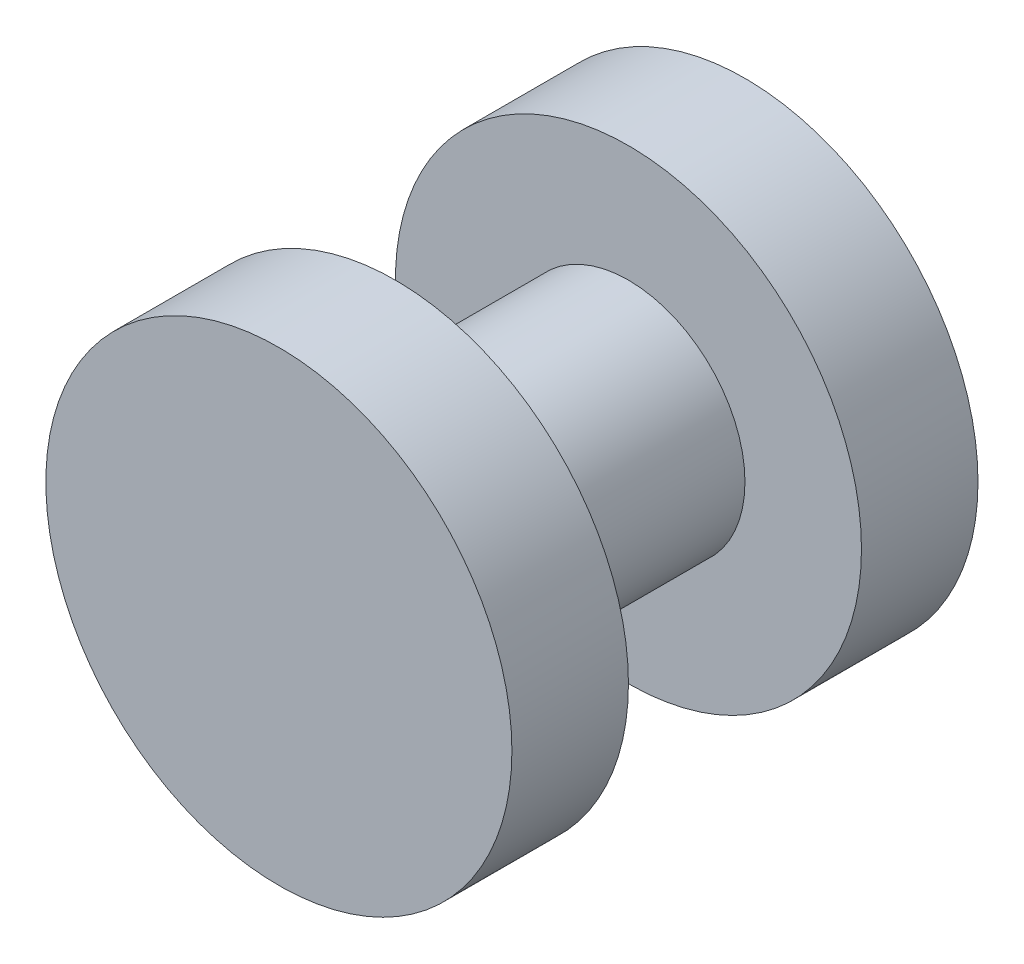
ISO-10303-21;
HEADER;
FILE_DESCRIPTION(('STEP AP214'),'2;1');
FILE_NAME('part.step','',(''),(''),'','','');
FILE_SCHEMA(('AUTOMOTIVE_DESIGN { 1 0 10303 214 1 1 1 1 }'));
ENDSEC;
DATA;
#1=APPLICATION_CONTEXT('core data for automotive mechanical design processes');
#2=APPLICATION_PROTOCOL_DEFINITION('international standard','automotive_design',2000,#1);
#3=PRODUCT_CONTEXT('',#1,'mechanical');
#4=PRODUCT('Part','Part','',(#3));
#5=PRODUCT_RELATED_PRODUCT_CATEGORY('part','',(#4));
#6=PRODUCT_DEFINITION_FORMATION('','',#4);
#7=PRODUCT_DEFINITION_CONTEXT('part definition',#1,'design');
#8=PRODUCT_DEFINITION('design','',#6,#7);
#9=PRODUCT_DEFINITION_SHAPE('','',#8);
#10=(LENGTH_UNIT() NAMED_UNIT(*) SI_UNIT(.MILLI.,.METRE.));
#11=(NAMED_UNIT(*) PLANE_ANGLE_UNIT() SI_UNIT($,.RADIAN.));
#12=(NAMED_UNIT(*) SI_UNIT($,.STERADIAN.) SOLID_ANGLE_UNIT());
#13=UNCERTAINTY_MEASURE_WITH_UNIT(LENGTH_MEASURE(1.E-05),#10,'distance_accuracy_value','');
#14=(GEOMETRIC_REPRESENTATION_CONTEXT(3) GLOBAL_UNCERTAINTY_ASSIGNED_CONTEXT((#13)) GLOBAL_UNIT_ASSIGNED_CONTEXT((#10,
#11,#12)) REPRESENTATION_CONTEXT('',''));
#15=CARTESIAN_POINT('',(0.,0.,0.));
#16=DIRECTION('',(0.,0.,1.));
#17=DIRECTION('',(1.,0.,0.));
#18=AXIS2_PLACEMENT_3D('',#15,#16,#17);
#19=CARTESIAN_POINT('',(0.,0.,3.175));
#20=DIRECTION('',(0.,0.,1.));
#21=DIRECTION('',(1.,0.,0.));
#22=AXIS2_PLACEMENT_3D('',#19,#20,#21);
#23=PLANE('',#22);
#24=CARTESIAN_POINT('',(0.,0.,3.175));
#25=DIRECTION('',(0.,0.,1.));
#26=DIRECTION('',(1.,0.,0.));
#27=AXIS2_PLACEMENT_3D('',#24,#25,#26);
#28=CIRCLE('',#27,6.35);
#29=CARTESIAN_POINT('',(6.35,0.,3.175));
#30=VERTEX_POINT('',#29);
#31=EDGE_CURVE('E10',#30,#30,#28,.T.);
#32=ORIENTED_EDGE('',*,*,#31,.T.);
#33=EDGE_LOOP('',(#32));
#34=FACE_BOUND('',#33,.T.);
#35=CARTESIAN_POINT('',(0.,0.,3.175));
#36=DIRECTION('',(0.,0.,1.));
#37=DIRECTION('',(1.,0.,0.));
#38=AXIS2_PLACEMENT_3D('',#35,#36,#37);
#39=CIRCLE('',#38,3.175);
#40=CARTESIAN_POINT('',(3.175,0.,3.175));
#41=VERTEX_POINT('',#40);
#42=EDGE_CURVE('E43',#41,#41,#39,.T.);
#43=ORIENTED_EDGE('',*,*,#42,.F.);
#44=EDGE_LOOP('',(#43));
#45=FACE_BOUND('',#44,.T.);
#46=ADVANCED_FACE('F30',(#34,#45),#23,.T.);
#47=CARTESIAN_POINT('',(0.,0.,3.175));
#48=DIRECTION('',(0.,0.,-1.));
#49=DIRECTION('',(-1.,0.,0.));
#50=AXIS2_PLACEMENT_3D('',#47,#48,#49);
#51=CYLINDRICAL_SURFACE('',#50,6.35);
#52=ORIENTED_EDGE('',*,*,#31,.F.);
#53=EDGE_LOOP('',(#52));
#54=FACE_BOUND('',#53,.T.);
#55=CARTESIAN_POINT('',(0.,0.,0.));
#56=DIRECTION('',(0.,0.,1.));
#57=DIRECTION('',(1.,0.,0.));
#58=AXIS2_PLACEMENT_3D('',#55,#56,#57);
#59=CIRCLE('',#58,6.35);
#60=CARTESIAN_POINT('',(6.35,0.,0.));
#61=VERTEX_POINT('',#60);
#62=EDGE_CURVE('E34',#61,#61,#59,.T.);
#63=ORIENTED_EDGE('',*,*,#62,.T.);
#64=EDGE_LOOP('',(#63));
#65=FACE_BOUND('',#64,.T.);
#66=ADVANCED_FACE('F32',(#54,#65),#51,.T.);
#67=CARTESIAN_POINT('',(0.,0.,0.));
#68=DIRECTION('',(0.,0.,1.));
#69=DIRECTION('',(1.,0.,0.));
#70=AXIS2_PLACEMENT_3D('',#67,#68,#69);
#71=PLANE('',#70);
#72=ORIENTED_EDGE('',*,*,#62,.F.);
#73=EDGE_LOOP('',(#72));
#74=FACE_BOUND('',#73,.T.);
#75=ADVANCED_FACE('F72',(#74),#71,.F.);
#76=CARTESIAN_POINT('',(0.,0.,9.525));
#77=DIRECTION('',(0.,0.,-1.));
#78=DIRECTION('',(-1.,0.,0.));
#79=AXIS2_PLACEMENT_3D('',#76,#77,#78);
#80=CYLINDRICAL_SURFACE('',#79,3.175);
#81=CARTESIAN_POINT('',(0.,0.,9.525));
#82=DIRECTION('',(0.,0.,1.));
#83=DIRECTION('',(1.,0.,0.));
#84=AXIS2_PLACEMENT_3D('',#81,#82,#83);
#85=CIRCLE('',#84,3.175);
#86=CARTESIAN_POINT('',(3.175,0.,9.525));
#87=VERTEX_POINT('',#86);
#88=EDGE_CURVE('E41',#87,#87,#85,.T.);
#89=ORIENTED_EDGE('',*,*,#88,.F.);
#90=EDGE_LOOP('',(#89));
#91=FACE_BOUND('',#90,.T.);
#92=ORIENTED_EDGE('',*,*,#42,.T.);
#93=EDGE_LOOP('',(#92));
#94=FACE_BOUND('',#93,.T.);
#95=ADVANCED_FACE('F66',(#91,#94),#80,.T.);
#96=CARTESIAN_POINT('',(0.,0.,9.525));
#97=DIRECTION('',(0.,0.,1.));
#98=DIRECTION('',(1.,0.,0.));
#99=AXIS2_PLACEMENT_3D('',#96,#97,#98);
#100=PLANE('',#99);
#101=CARTESIAN_POINT('',(0.,0.,9.525));
#102=DIRECTION('',(0.,0.,1.));
#103=DIRECTION('',(1.,0.,0.));
#104=AXIS2_PLACEMENT_3D('',#101,#102,#103);
#105=CIRCLE('',#104,6.35);
#106=CARTESIAN_POINT('',(6.35,0.,9.525));
#107=VERTEX_POINT('',#106);
#108=EDGE_CURVE('E49',#107,#107,#105,.T.);
#109=ORIENTED_EDGE('',*,*,#108,.F.);
#110=EDGE_LOOP('',(#109));
#111=FACE_BOUND('',#110,.T.);
#112=ORIENTED_EDGE('',*,*,#88,.T.);
#113=EDGE_LOOP('',(#112));
#114=FACE_BOUND('',#113,.T.);
#115=ADVANCED_FACE('F60',(#111,#114),#100,.F.);
#116=CARTESIAN_POINT('',(0.,0.,12.7));
#117=DIRECTION('',(0.,0.,-1.));
#118=DIRECTION('',(-1.,0.,0.));
#119=AXIS2_PLACEMENT_3D('',#116,#117,#118);
#120=CYLINDRICAL_SURFACE('',#119,6.35);
#121=CARTESIAN_POINT('',(0.,0.,12.7));
#122=DIRECTION('',(0.,0.,1.));
#123=DIRECTION('',(1.,0.,0.));
#124=AXIS2_PLACEMENT_3D('',#121,#122,#123);
#125=CIRCLE('',#124,6.35);
#126=CARTESIAN_POINT('',(6.35,0.,12.7));
#127=VERTEX_POINT('',#126);
#128=EDGE_CURVE('E46',#127,#127,#125,.T.);
#129=ORIENTED_EDGE('',*,*,#128,.F.);
#130=EDGE_LOOP('',(#129));
#131=FACE_BOUND('',#130,.T.);
#132=ORIENTED_EDGE('',*,*,#108,.T.);
#133=EDGE_LOOP('',(#132));
#134=FACE_BOUND('',#133,.T.);
#135=ADVANCED_FACE('F57',(#131,#134),#120,.T.);
#136=CARTESIAN_POINT('',(0.,0.,12.7));
#137=DIRECTION('',(0.,0.,1.));
#138=DIRECTION('',(1.,0.,0.));
#139=AXIS2_PLACEMENT_3D('',#136,#137,#138);
#140=PLANE('',#139);
#141=ORIENTED_EDGE('',*,*,#128,.T.);
#142=EDGE_LOOP('',(#141));
#143=FACE_BOUND('',#142,.T.);
#144=ADVANCED_FACE('F55',(#143),#140,.T.);
#145=CLOSED_SHELL('',(#46,#66,#75,#95,#115,#135,#144));
#146=MANIFOLD_SOLID_BREP('B2',#145);
#147=ADVANCED_BREP_SHAPE_REPRESENTATION('',(#18,#146),#14);
#148=SHAPE_DEFINITION_REPRESENTATION(#9,#147);
ENDSEC;
END-ISO-10303-21;
